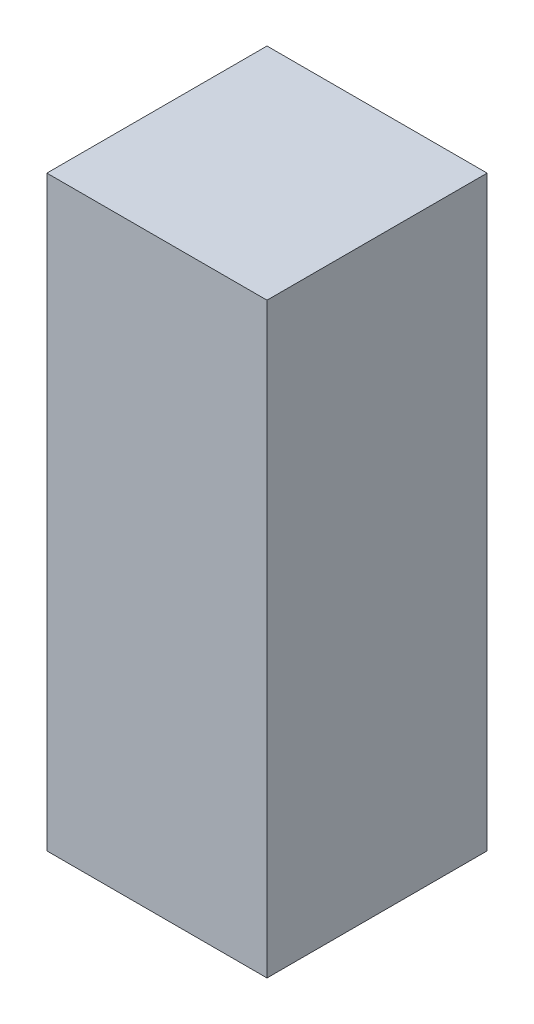
ISO-10303-21;
HEADER;
FILE_DESCRIPTION(('STEP AP214'),'2;1');
FILE_NAME('part.step','',(''),(''),'','','');
FILE_SCHEMA(('AUTOMOTIVE_DESIGN { 1 0 10303 214 1 1 1 1 }'));
ENDSEC;
DATA;
#1=APPLICATION_CONTEXT('core data for automotive mechanical design processes');
#2=APPLICATION_PROTOCOL_DEFINITION('international standard','automotive_design',2000,#1);
#3=PRODUCT_CONTEXT('',#1,'mechanical');
#4=PRODUCT('Part','Part','',(#3));
#5=PRODUCT_RELATED_PRODUCT_CATEGORY('part','',(#4));
#6=PRODUCT_DEFINITION_FORMATION('','',#4);
#7=PRODUCT_DEFINITION_CONTEXT('part definition',#1,'design');
#8=PRODUCT_DEFINITION('design','',#6,#7);
#9=PRODUCT_DEFINITION_SHAPE('','',#8);
#10=(LENGTH_UNIT() NAMED_UNIT(*) SI_UNIT(.MILLI.,.METRE.));
#11=(NAMED_UNIT(*) PLANE_ANGLE_UNIT() SI_UNIT($,.RADIAN.));
#12=(NAMED_UNIT(*) SI_UNIT($,.STERADIAN.) SOLID_ANGLE_UNIT());
#13=UNCERTAINTY_MEASURE_WITH_UNIT(LENGTH_MEASURE(1.E-05),#10,'distance_accuracy_value','');
#14=(GEOMETRIC_REPRESENTATION_CONTEXT(3) GLOBAL_UNCERTAINTY_ASSIGNED_CONTEXT((#13)) GLOBAL_UNIT_ASSIGNED_CONTEXT((#10,
#11,#12)) REPRESENTATION_CONTEXT('',''));
#15=CARTESIAN_POINT('',(0.,0.,0.));
#16=DIRECTION('',(0.,0.,1.));
#17=DIRECTION('',(1.,0.,0.));
#18=AXIS2_PLACEMENT_3D('',#15,#16,#17);
#19=CARTESIAN_POINT('',(9.525,50.8,9.525));
#20=DIRECTION('',(-1.,0.,0.));
#21=DIRECTION('',(0.,0.,1.));
#22=AXIS2_PLACEMENT_3D('',#19,#20,#21);
#23=PLANE('',#22);
#24=DIRECTION('',(0.,0.,-1.));
#25=VECTOR('',#24,1.);
#26=CARTESIAN_POINT('',(9.525,0.,9.525));
#27=LINE('',#26,#25);
#28=CARTESIAN_POINT('',(9.525,0.,9.525));
#29=VERTEX_POINT('',#28);
#30=CARTESIAN_POINT('',(9.525,0.,-9.525));
#31=VERTEX_POINT('',#30);
#32=EDGE_CURVE('E100',#29,#31,#27,.T.);
#33=ORIENTED_EDGE('',*,*,#32,.T.);
#34=DIRECTION('',(0.,-1.,0.));
#35=VECTOR('',#34,1.);
#36=CARTESIAN_POINT('',(9.525,50.8,-9.525));
#37=LINE('',#36,#35);
#38=CARTESIAN_POINT('',(9.525,50.8,-9.525));
#39=VERTEX_POINT('',#38);
#40=EDGE_CURVE('E11',#39,#31,#37,.T.);
#41=ORIENTED_EDGE('',*,*,#40,.F.);
#42=DIRECTION('',(0.,0.,-1.));
#43=VECTOR('',#42,1.);
#44=CARTESIAN_POINT('',(9.525,50.8,9.525));
#45=LINE('',#44,#43);
#46=CARTESIAN_POINT('',(9.525,50.8,9.525));
#47=VERTEX_POINT('',#46);
#48=EDGE_CURVE('E88',#47,#39,#45,.T.);
#49=ORIENTED_EDGE('',*,*,#48,.F.);
#50=DIRECTION('',(0.,-1.,0.));
#51=VECTOR('',#50,1.);
#52=CARTESIAN_POINT('',(9.525,50.8,9.525));
#53=LINE('',#52,#51);
#54=EDGE_CURVE('E96',#47,#29,#53,.T.);
#55=ORIENTED_EDGE('',*,*,#54,.T.);
#56=EDGE_LOOP('',(#33,#41,#49,#55));
#57=FACE_BOUND('',#56,.T.);
#58=ADVANCED_FACE('F37',(#57),#23,.F.);
#59=CARTESIAN_POINT('',(-9.52500000000001,50.8,-9.525));
#60=DIRECTION('',(0.,0.,1.));
#61=DIRECTION('',(1.,0.,0.));
#62=AXIS2_PLACEMENT_3D('',#59,#60,#61);
#63=PLANE('',#62);
#64=DIRECTION('',(-1.,0.,0.));
#65=VECTOR('',#64,1.);
#66=CARTESIAN_POINT('',(-9.52500000000001,0.,-9.525));
#67=LINE('',#66,#65);
#68=CARTESIAN_POINT('',(-9.52500000000001,0.,-9.525));
#69=VERTEX_POINT('',#68);
#70=EDGE_CURVE('E92',#31,#69,#67,.T.);
#71=ORIENTED_EDGE('',*,*,#70,.T.);
#72=DIRECTION('',(0.,-1.,0.));
#73=VECTOR('',#72,1.);
#74=CARTESIAN_POINT('',(-9.52500000000001,50.8,-9.525));
#75=LINE('',#74,#73);
#76=CARTESIAN_POINT('',(-9.52500000000001,50.8,-9.525));
#77=VERTEX_POINT('',#76);
#78=EDGE_CURVE('E45',#77,#69,#75,.T.);
#79=ORIENTED_EDGE('',*,*,#78,.F.);
#80=DIRECTION('',(-1.,0.,0.));
#81=VECTOR('',#80,1.);
#82=CARTESIAN_POINT('',(-9.52500000000001,50.8,-9.525));
#83=LINE('',#82,#81);
#84=EDGE_CURVE('E83',#39,#77,#83,.T.);
#85=ORIENTED_EDGE('',*,*,#84,.F.);
#86=ORIENTED_EDGE('',*,*,#40,.T.);
#87=EDGE_LOOP('',(#71,#79,#85,#86));
#88=FACE_BOUND('',#87,.T.);
#89=ADVANCED_FACE('F91',(#88),#63,.F.);
#90=CARTESIAN_POINT('',(-9.52500000000001,50.8,9.525));
#91=DIRECTION('',(1.,0.,0.));
#92=DIRECTION('',(0.,0.,-1.));
#93=AXIS2_PLACEMENT_3D('',#90,#91,#92);
#94=PLANE('',#93);
#95=DIRECTION('',(0.,0.,1.));
#96=VECTOR('',#95,1.);
#97=CARTESIAN_POINT('',(-9.52500000000001,0.,9.525));
#98=LINE('',#97,#96);
#99=CARTESIAN_POINT('',(-9.52500000000001,0.,9.525));
#100=VERTEX_POINT('',#99);
#101=EDGE_CURVE('E70',#69,#100,#98,.T.);
#102=ORIENTED_EDGE('',*,*,#101,.T.);
#103=DIRECTION('',(0.,-1.,0.));
#104=VECTOR('',#103,1.);
#105=CARTESIAN_POINT('',(-9.52500000000001,50.8,9.525));
#106=LINE('',#105,#104);
#107=CARTESIAN_POINT('',(-9.52500000000001,50.8,9.525));
#108=VERTEX_POINT('',#107);
#109=EDGE_CURVE('E93',#108,#100,#106,.T.);
#110=ORIENTED_EDGE('',*,*,#109,.F.);
#111=DIRECTION('',(0.,0.,1.));
#112=VECTOR('',#111,1.);
#113=CARTESIAN_POINT('',(-9.52500000000001,50.8,9.525));
#114=LINE('',#113,#112);
#115=EDGE_CURVE('E86',#77,#108,#114,.T.);
#116=ORIENTED_EDGE('',*,*,#115,.F.);
#117=ORIENTED_EDGE('',*,*,#78,.T.);
#118=EDGE_LOOP('',(#102,#110,#116,#117));
#119=FACE_BOUND('',#118,.T.);
#120=ADVANCED_FACE('F94',(#119),#94,.F.);
#121=CARTESIAN_POINT('',(-9.52500000000001,50.8,9.525));
#122=DIRECTION('',(0.,0.,-1.));
#123=DIRECTION('',(-1.,0.,0.));
#124=AXIS2_PLACEMENT_3D('',#121,#122,#123);
#125=PLANE('',#124);
#126=DIRECTION('',(1.,0.,0.));
#127=VECTOR('',#126,1.);
#128=CARTESIAN_POINT('',(-9.52500000000001,0.,9.525));
#129=LINE('',#128,#127);
#130=EDGE_CURVE('E76',#100,#29,#129,.T.);
#131=ORIENTED_EDGE('',*,*,#130,.T.);
#132=ORIENTED_EDGE('',*,*,#54,.F.);
#133=DIRECTION('',(1.,0.,0.));
#134=VECTOR('',#133,1.);
#135=CARTESIAN_POINT('',(-9.52500000000001,50.8,9.525));
#136=LINE('',#135,#134);
#137=EDGE_CURVE('E53',#108,#47,#136,.T.);
#138=ORIENTED_EDGE('',*,*,#137,.F.);
#139=ORIENTED_EDGE('',*,*,#109,.T.);
#140=EDGE_LOOP('',(#131,#132,#138,#139));
#141=FACE_BOUND('',#140,.T.);
#142=ADVANCED_FACE('F107',(#141),#125,.F.);
#143=CARTESIAN_POINT('',(0.,50.8,0.));
#144=DIRECTION('',(0.,-1.,0.));
#145=DIRECTION('',(0.,0.,-1.));
#146=AXIS2_PLACEMENT_3D('',#143,#144,#145);
#147=PLANE('',#146);
#148=ORIENTED_EDGE('',*,*,#48,.T.);
#149=ORIENTED_EDGE('',*,*,#84,.T.);
#150=ORIENTED_EDGE('',*,*,#115,.T.);
#151=ORIENTED_EDGE('',*,*,#137,.T.);
#152=EDGE_LOOP('',(#148,#149,#150,#151));
#153=FACE_BOUND('',#152,.T.);
#154=ADVANCED_FACE('F84',(#153),#147,.F.);
#155=CARTESIAN_POINT('',(0.,0.,0.));
#156=DIRECTION('',(0.,-1.,0.));
#157=DIRECTION('',(0.,0.,-1.));
#158=AXIS2_PLACEMENT_3D('',#155,#156,#157);
#159=PLANE('',#158);
#160=ORIENTED_EDGE('',*,*,#32,.F.);
#161=ORIENTED_EDGE('',*,*,#130,.F.);
#162=ORIENTED_EDGE('',*,*,#101,.F.);
#163=ORIENTED_EDGE('',*,*,#70,.F.);
#164=EDGE_LOOP('',(#160,#161,#162,#163));
#165=FACE_BOUND('',#164,.T.);
#166=ADVANCED_FACE('F110',(#165),#159,.T.);
#167=CLOSED_SHELL('',(#58,#89,#120,#142,#154,#166));
#168=MANIFOLD_SOLID_BREP('B2',#167);
#169=ADVANCED_BREP_SHAPE_REPRESENTATION('',(#18,#168),#14);
#170=SHAPE_DEFINITION_REPRESENTATION(#9,#169);
ENDSEC;
END-ISO-10303-21;
